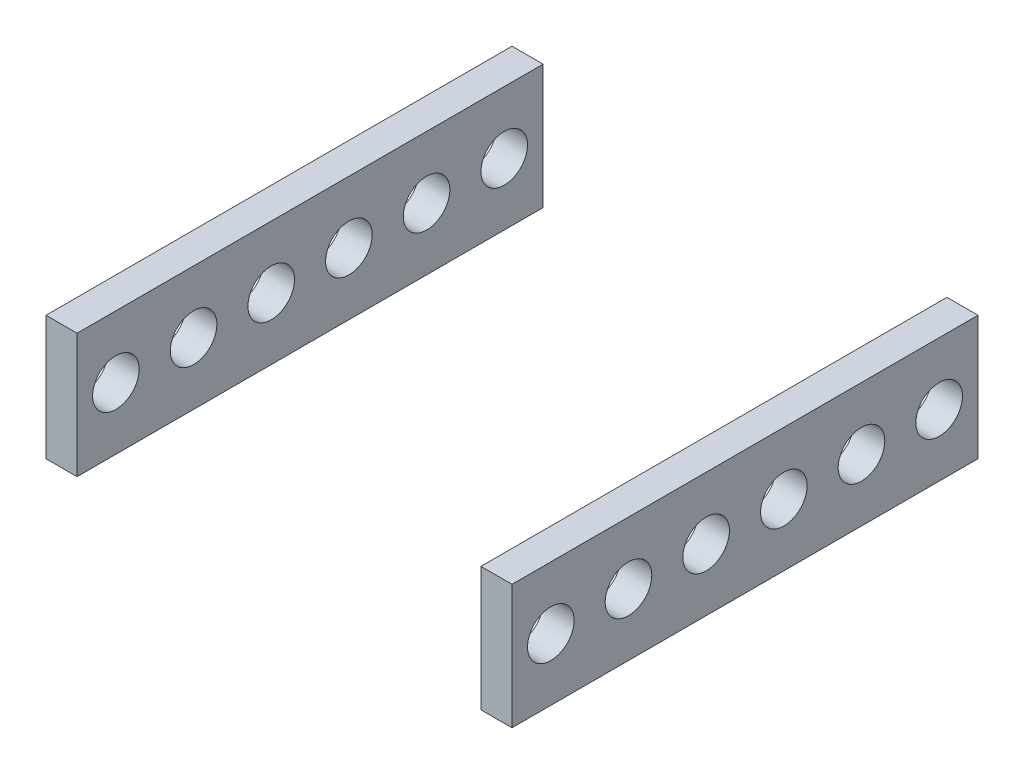
ISO-10303-21;
HEADER;
FILE_DESCRIPTION(('STEP AP214'),'2;1');
FILE_NAME('part.step','',(''),(''),'','','');
FILE_SCHEMA(('AUTOMOTIVE_DESIGN { 1 0 10303 214 1 1 1 1 }'));
ENDSEC;
DATA;
#1=APPLICATION_CONTEXT('core data for automotive mechanical design processes');
#2=APPLICATION_PROTOCOL_DEFINITION('international standard','automotive_design',2000,#1);
#3=PRODUCT_CONTEXT('',#1,'mechanical');
#4=PRODUCT('Part','Part','',(#3));
#5=PRODUCT_RELATED_PRODUCT_CATEGORY('part','',(#4));
#6=PRODUCT_DEFINITION_FORMATION('','',#4);
#7=PRODUCT_DEFINITION_CONTEXT('part definition',#1,'design');
#8=PRODUCT_DEFINITION('design','',#6,#7);
#9=PRODUCT_DEFINITION_SHAPE('','',#8);
#10=(LENGTH_UNIT() NAMED_UNIT(*) SI_UNIT(.MILLI.,.METRE.));
#11=(NAMED_UNIT(*) PLANE_ANGLE_UNIT() SI_UNIT($,.RADIAN.));
#12=(NAMED_UNIT(*) SI_UNIT($,.STERADIAN.) SOLID_ANGLE_UNIT());
#13=UNCERTAINTY_MEASURE_WITH_UNIT(LENGTH_MEASURE(1.E-05),#10,'distance_accuracy_value','');
#14=(GEOMETRIC_REPRESENTATION_CONTEXT(3) GLOBAL_UNCERTAINTY_ASSIGNED_CONTEXT((#13)) GLOBAL_UNIT_ASSIGNED_CONTEXT((#10,
#11,#12)) REPRESENTATION_CONTEXT('',''));
#15=CARTESIAN_POINT('',(0.,0.,0.));
#16=DIRECTION('',(0.,0.,1.));
#17=DIRECTION('',(1.,0.,0.));
#18=AXIS2_PLACEMENT_3D('',#15,#16,#17);
#19=CARTESIAN_POINT('',(-254.832138860458,0.,300.));
#20=DIRECTION('',(1.,0.,0.));
#21=DIRECTION('',(0.,0.,-1.));
#22=AXIS2_PLACEMENT_3D('',#19,#20,#21);
#23=PLANE('',#22);
#24=CARTESIAN_POINT('',(-254.832138860458,-10.8737780043899,225.));
#25=DIRECTION('',(1.,0.,0.));
#26=DIRECTION('',(0.,0.,-1.));
#27=AXIS2_PLACEMENT_3D('',#24,#25,#26);
#28=CIRCLE('',#27,15.);
#29=CARTESIAN_POINT('',(-254.832138860458,-10.8737780043899,210.));
#30=VERTEX_POINT('',#29);
#31=EDGE_CURVE('E148',#30,#30,#28,.T.);
#32=ORIENTED_EDGE('',*,*,#31,.F.);
#33=EDGE_LOOP('',(#32));
#34=FACE_BOUND('',#33,.T.);
#35=CARTESIAN_POINT('',(-254.832138860458,-10.8737780043899,175.));
#36=DIRECTION('',(1.,0.,0.));
#37=DIRECTION('',(0.,0.,-1.));
#38=AXIS2_PLACEMENT_3D('',#35,#36,#37);
#39=CIRCLE('',#38,15.);
#40=CARTESIAN_POINT('',(-254.832138860458,-10.8737780043899,160.));
#41=VERTEX_POINT('',#40);
#42=EDGE_CURVE('E142',#41,#41,#39,.T.);
#43=ORIENTED_EDGE('',*,*,#42,.F.);
#44=EDGE_LOOP('',(#43));
#45=FACE_BOUND('',#44,.T.);
#46=CARTESIAN_POINT('',(-254.832138860458,-10.8737780043899,125.));
#47=DIRECTION('',(1.,0.,0.));
#48=DIRECTION('',(0.,0.,-1.));
#49=AXIS2_PLACEMENT_3D('',#46,#47,#48);
#50=CIRCLE('',#49,15.);
#51=CARTESIAN_POINT('',(-254.832138860458,-10.8737780043899,110.));
#52=VERTEX_POINT('',#51);
#53=EDGE_CURVE('E136',#52,#52,#50,.T.);
#54=ORIENTED_EDGE('',*,*,#53,.F.);
#55=EDGE_LOOP('',(#54));
#56=FACE_BOUND('',#55,.T.);
#57=CARTESIAN_POINT('',(-254.832138860458,-10.8737780043899,75.));
#58=DIRECTION('',(1.,0.,0.));
#59=DIRECTION('',(0.,0.,-1.));
#60=AXIS2_PLACEMENT_3D('',#57,#58,#59);
#61=CIRCLE('',#60,15.);
#62=CARTESIAN_POINT('',(-254.832138860458,-10.8737780043899,60.));
#63=VERTEX_POINT('',#62);
#64=EDGE_CURVE('E130',#63,#63,#61,.T.);
#65=ORIENTED_EDGE('',*,*,#64,.F.);
#66=EDGE_LOOP('',(#65));
#67=FACE_BOUND('',#66,.T.);
#68=CARTESIAN_POINT('',(-254.832138860458,-10.8737780043899,275.));
#69=DIRECTION('',(1.,0.,0.));
#70=DIRECTION('',(0.,0.,-1.));
#71=AXIS2_PLACEMENT_3D('',#68,#69,#70);
#72=CIRCLE('',#71,15.);
#73=CARTESIAN_POINT('',(-254.832138860458,-10.8737780043899,260.));
#74=VERTEX_POINT('',#73);
#75=EDGE_CURVE('E124',#74,#74,#72,.T.);
#76=ORIENTED_EDGE('',*,*,#75,.F.);
#77=EDGE_LOOP('',(#76));
#78=FACE_BOUND('',#77,.T.);
#79=CARTESIAN_POINT('',(-254.832138860458,-10.8737780043899,25.));
#80=DIRECTION('',(1.,0.,0.));
#81=DIRECTION('',(0.,0.,-1.));
#82=AXIS2_PLACEMENT_3D('',#79,#80,#81);
#83=CIRCLE('',#82,15.);
#84=CARTESIAN_POINT('',(-254.832138860458,-10.8737780043899,10.));
#85=VERTEX_POINT('',#84);
#86=EDGE_CURVE('E109',#85,#85,#83,.T.);
#87=ORIENTED_EDGE('',*,*,#86,.F.);
#88=EDGE_LOOP('',(#87));
#89=FACE_BOUND('',#88,.T.);
#90=DIRECTION('',(0.,-1.,0.));
#91=VECTOR('',#90,1.);
#92=CARTESIAN_POINT('',(-254.832138860458,0.,0.));
#93=LINE('',#92,#91);
#94=CARTESIAN_POINT('',(-254.832138860458,29.12622199561,0.));
#95=VERTEX_POINT('',#94);
#96=CARTESIAN_POINT('',(-254.832138860458,-50.8737780043899,0.));
#97=VERTEX_POINT('',#96);
#98=EDGE_CURVE('E107',#95,#97,#93,.T.);
#99=ORIENTED_EDGE('',*,*,#98,.F.);
#100=DIRECTION('',(0.,0.,-1.));
#101=VECTOR('',#100,1.);
#102=CARTESIAN_POINT('',(-254.832138860458,29.12622199561,300.));
#103=LINE('',#102,#101);
#104=CARTESIAN_POINT('',(-254.832138860458,29.12622199561,300.));
#105=VERTEX_POINT('',#104);
#106=EDGE_CURVE('E12',#105,#95,#103,.T.);
#107=ORIENTED_EDGE('',*,*,#106,.F.);
#108=DIRECTION('',(0.,-1.,0.));
#109=VECTOR('',#108,1.);
#110=CARTESIAN_POINT('',(-254.832138860458,0.,300.));
#111=LINE('',#110,#109);
#112=CARTESIAN_POINT('',(-254.832138860458,-50.8737780043899,300.));
#113=VERTEX_POINT('',#112);
#114=EDGE_CURVE('E92',#105,#113,#111,.T.);
#115=ORIENTED_EDGE('',*,*,#114,.T.);
#116=DIRECTION('',(0.,0.,-1.));
#117=VECTOR('',#116,1.);
#118=CARTESIAN_POINT('',(-254.832138860458,-50.8737780043899,300.));
#119=LINE('',#118,#117);
#120=EDGE_CURVE('E60',#113,#97,#119,.T.);
#121=ORIENTED_EDGE('',*,*,#120,.T.);
#122=EDGE_LOOP('',(#99,#107,#115,#121));
#123=FACE_BOUND('',#122,.T.);
#124=ADVANCED_FACE('F44',(#34,#45,#56,#67,#78,#89,#123),#23,.T.);
#125=CARTESIAN_POINT('',(0.,29.12622199561,300.));
#126=DIRECTION('',(0.,-1.,0.));
#127=DIRECTION('',(0.,0.,-1.));
#128=AXIS2_PLACEMENT_3D('',#125,#126,#127);
#129=PLANE('',#128);
#130=DIRECTION('',(-1.,0.,0.));
#131=VECTOR('',#130,1.);
#132=CARTESIAN_POINT('',(0.,29.12622199561,0.));
#133=LINE('',#132,#131);
#134=CARTESIAN_POINT('',(-274.832138860458,29.12622199561,0.));
#135=VERTEX_POINT('',#134);
#136=EDGE_CURVE('E98',#95,#135,#133,.T.);
#137=ORIENTED_EDGE('',*,*,#136,.T.);
#138=DIRECTION('',(0.,0.,-1.));
#139=VECTOR('',#138,1.);
#140=CARTESIAN_POINT('',(-274.832138860458,29.12622199561,300.));
#141=LINE('',#140,#139);
#142=CARTESIAN_POINT('',(-274.832138860458,29.12622199561,300.));
#143=VERTEX_POINT('',#142);
#144=EDGE_CURVE('E52',#143,#135,#141,.T.);
#145=ORIENTED_EDGE('',*,*,#144,.F.);
#146=DIRECTION('',(-1.,0.,0.));
#147=VECTOR('',#146,1.);
#148=CARTESIAN_POINT('',(0.,29.12622199561,300.));
#149=LINE('',#148,#147);
#150=EDGE_CURVE('E86',#105,#143,#149,.T.);
#151=ORIENTED_EDGE('',*,*,#150,.F.);
#152=ORIENTED_EDGE('',*,*,#106,.T.);
#153=EDGE_LOOP('',(#137,#145,#151,#152));
#154=FACE_BOUND('',#153,.T.);
#155=ADVANCED_FACE('F96',(#154),#129,.F.);
#156=CARTESIAN_POINT('',(-274.832138860458,0.,300.));
#157=DIRECTION('',(1.,0.,0.));
#158=DIRECTION('',(0.,0.,-1.));
#159=AXIS2_PLACEMENT_3D('',#156,#157,#158);
#160=PLANE('',#159);
#161=CARTESIAN_POINT('',(-274.832138860458,-10.8737780043899,225.));
#162=DIRECTION('',(-1.,0.,0.));
#163=DIRECTION('',(0.,0.,1.));
#164=AXIS2_PLACEMENT_3D('',#161,#162,#163);
#165=CIRCLE('',#164,15.);
#166=CARTESIAN_POINT('',(-274.832138860458,-10.8737780043899,240.));
#167=VERTEX_POINT('',#166);
#168=EDGE_CURVE('E151',#167,#167,#165,.T.);
#169=ORIENTED_EDGE('',*,*,#168,.F.);
#170=EDGE_LOOP('',(#169));
#171=FACE_BOUND('',#170,.T.);
#172=CARTESIAN_POINT('',(-274.832138860458,-10.8737780043899,175.));
#173=DIRECTION('',(-1.,0.,0.));
#174=DIRECTION('',(0.,0.,1.));
#175=AXIS2_PLACEMENT_3D('',#172,#173,#174);
#176=CIRCLE('',#175,15.);
#177=CARTESIAN_POINT('',(-274.832138860458,-10.8737780043899,190.));
#178=VERTEX_POINT('',#177);
#179=EDGE_CURVE('E145',#178,#178,#176,.T.);
#180=ORIENTED_EDGE('',*,*,#179,.F.);
#181=EDGE_LOOP('',(#180));
#182=FACE_BOUND('',#181,.T.);
#183=CARTESIAN_POINT('',(-274.832138860458,-10.8737780043899,125.));
#184=DIRECTION('',(-1.,0.,0.));
#185=DIRECTION('',(0.,0.,1.));
#186=AXIS2_PLACEMENT_3D('',#183,#184,#185);
#187=CIRCLE('',#186,15.);
#188=CARTESIAN_POINT('',(-274.832138860458,-10.8737780043899,140.));
#189=VERTEX_POINT('',#188);
#190=EDGE_CURVE('E139',#189,#189,#187,.T.);
#191=ORIENTED_EDGE('',*,*,#190,.F.);
#192=EDGE_LOOP('',(#191));
#193=FACE_BOUND('',#192,.T.);
#194=CARTESIAN_POINT('',(-274.832138860458,-10.8737780043899,75.));
#195=DIRECTION('',(-1.,0.,0.));
#196=DIRECTION('',(0.,0.,1.));
#197=AXIS2_PLACEMENT_3D('',#194,#195,#196);
#198=CIRCLE('',#197,15.);
#199=CARTESIAN_POINT('',(-274.832138860458,-10.8737780043899,90.));
#200=VERTEX_POINT('',#199);
#201=EDGE_CURVE('E133',#200,#200,#198,.T.);
#202=ORIENTED_EDGE('',*,*,#201,.F.);
#203=EDGE_LOOP('',(#202));
#204=FACE_BOUND('',#203,.T.);
#205=CARTESIAN_POINT('',(-274.832138860458,-10.8737780043899,275.));
#206=DIRECTION('',(-1.,0.,0.));
#207=DIRECTION('',(0.,0.,1.));
#208=AXIS2_PLACEMENT_3D('',#205,#206,#207);
#209=CIRCLE('',#208,15.);
#210=CARTESIAN_POINT('',(-274.832138860458,-10.8737780043899,290.));
#211=VERTEX_POINT('',#210);
#212=EDGE_CURVE('E127',#211,#211,#209,.T.);
#213=ORIENTED_EDGE('',*,*,#212,.F.);
#214=EDGE_LOOP('',(#213));
#215=FACE_BOUND('',#214,.T.);
#216=CARTESIAN_POINT('',(-274.832138860458,-10.8737780043899,25.));
#217=DIRECTION('',(-1.,0.,0.));
#218=DIRECTION('',(0.,0.,1.));
#219=AXIS2_PLACEMENT_3D('',#216,#217,#218);
#220=CIRCLE('',#219,15.);
#221=CARTESIAN_POINT('',(-274.832138860458,-10.8737780043899,40.));
#222=VERTEX_POINT('',#221);
#223=EDGE_CURVE('E121',#222,#222,#220,.T.);
#224=ORIENTED_EDGE('',*,*,#223,.F.);
#225=EDGE_LOOP('',(#224));
#226=FACE_BOUND('',#225,.T.);
#227=DIRECTION('',(0.,-1.,0.));
#228=VECTOR('',#227,1.);
#229=CARTESIAN_POINT('',(-274.832138860458,0.,0.));
#230=LINE('',#229,#228);
#231=CARTESIAN_POINT('',(-274.832138860458,-50.8737780043899,0.));
#232=VERTEX_POINT('',#231);
#233=EDGE_CURVE('E111',#135,#232,#230,.T.);
#234=ORIENTED_EDGE('',*,*,#233,.T.);
#235=DIRECTION('',(0.,0.,-1.));
#236=VECTOR('',#235,1.);
#237=CARTESIAN_POINT('',(-274.832138860458,-50.8737780043899,300.));
#238=LINE('',#237,#236);
#239=CARTESIAN_POINT('',(-274.832138860458,-50.8737780043899,300.));
#240=VERTEX_POINT('',#239);
#241=EDGE_CURVE('E74',#240,#232,#238,.T.);
#242=ORIENTED_EDGE('',*,*,#241,.F.);
#243=DIRECTION('',(0.,-1.,0.));
#244=VECTOR('',#243,1.);
#245=CARTESIAN_POINT('',(-274.832138860458,0.,300.));
#246=LINE('',#245,#244);
#247=EDGE_CURVE('E91',#143,#240,#246,.T.);
#248=ORIENTED_EDGE('',*,*,#247,.F.);
#249=ORIENTED_EDGE('',*,*,#144,.T.);
#250=EDGE_LOOP('',(#234,#242,#248,#249));
#251=FACE_BOUND('',#250,.T.);
#252=ADVANCED_FACE('F101',(#171,#182,#193,#204,#215,#226,#251),#160,.F.);
#253=CARTESIAN_POINT('',(0.,-50.8737780043899,300.));
#254=DIRECTION('',(0.,-1.,0.));
#255=DIRECTION('',(0.,0.,-1.));
#256=AXIS2_PLACEMENT_3D('',#253,#254,#255);
#257=PLANE('',#256);
#258=DIRECTION('',(-1.,0.,0.));
#259=VECTOR('',#258,1.);
#260=CARTESIAN_POINT('',(0.,-50.8737780043899,0.));
#261=LINE('',#260,#259);
#262=EDGE_CURVE('E113',#97,#232,#261,.T.);
#263=ORIENTED_EDGE('',*,*,#262,.F.);
#264=ORIENTED_EDGE('',*,*,#120,.F.);
#265=DIRECTION('',(-1.,0.,0.));
#266=VECTOR('',#265,1.);
#267=CARTESIAN_POINT('',(0.,-50.8737780043899,300.));
#268=LINE('',#267,#266);
#269=EDGE_CURVE('E102',#113,#240,#268,.T.);
#270=ORIENTED_EDGE('',*,*,#269,.T.);
#271=ORIENTED_EDGE('',*,*,#241,.T.);
#272=EDGE_LOOP('',(#263,#264,#270,#271));
#273=FACE_BOUND('',#272,.T.);
#274=ADVANCED_FACE('F159',(#273),#257,.T.);
#275=CARTESIAN_POINT('',(0.,0.,300.));
#276=DIRECTION('',(0.,0.,1.));
#277=DIRECTION('',(1.,0.,0.));
#278=AXIS2_PLACEMENT_3D('',#275,#276,#277);
#279=PLANE('',#278);
#280=ORIENTED_EDGE('',*,*,#114,.F.);
#281=ORIENTED_EDGE('',*,*,#150,.T.);
#282=ORIENTED_EDGE('',*,*,#247,.T.);
#283=ORIENTED_EDGE('',*,*,#269,.F.);
#284=EDGE_LOOP('',(#280,#281,#282,#283));
#285=FACE_BOUND('',#284,.T.);
#286=ADVANCED_FACE('F88',(#285),#279,.T.);
#287=CARTESIAN_POINT('',(0.,0.,0.));
#288=DIRECTION('',(0.,0.,1.));
#289=DIRECTION('',(1.,0.,0.));
#290=AXIS2_PLACEMENT_3D('',#287,#288,#289);
#291=PLANE('',#290);
#292=ORIENTED_EDGE('',*,*,#98,.T.);
#293=ORIENTED_EDGE('',*,*,#262,.T.);
#294=ORIENTED_EDGE('',*,*,#233,.F.);
#295=ORIENTED_EDGE('',*,*,#136,.F.);
#296=EDGE_LOOP('',(#292,#293,#294,#295));
#297=FACE_BOUND('',#296,.T.);
#298=ADVANCED_FACE('F174',(#297),#291,.F.);
#299=CARTESIAN_POINT('',(25.1678611395419,-10.8737780043899,25.));
#300=DIRECTION('',(-1.,0.,0.));
#301=DIRECTION('',(0.,0.,1.));
#302=AXIS2_PLACEMENT_3D('',#299,#300,#301);
#303=CYLINDRICAL_SURFACE('',#302,15.);
#304=ORIENTED_EDGE('',*,*,#86,.T.);
#305=EDGE_LOOP('',(#304));
#306=FACE_BOUND('',#305,.T.);
#307=ORIENTED_EDGE('',*,*,#223,.T.);
#308=EDGE_LOOP('',(#307));
#309=FACE_BOUND('',#308,.T.);
#310=ADVANCED_FACE('F171',(#306,#309),#303,.F.);
#311=CARTESIAN_POINT('',(25.1678611395419,-10.8737780043899,275.));
#312=DIRECTION('',(-1.,0.,0.));
#313=DIRECTION('',(0.,0.,1.));
#314=AXIS2_PLACEMENT_3D('',#311,#312,#313);
#315=CYLINDRICAL_SURFACE('',#314,15.);
#316=ORIENTED_EDGE('',*,*,#75,.T.);
#317=EDGE_LOOP('',(#316));
#318=FACE_BOUND('',#317,.T.);
#319=ORIENTED_EDGE('',*,*,#212,.T.);
#320=EDGE_LOOP('',(#319));
#321=FACE_BOUND('',#320,.T.);
#322=ADVANCED_FACE('F173',(#318,#321),#315,.F.);
#323=CARTESIAN_POINT('',(25.1678611395419,-10.8737780043899,75.));
#324=DIRECTION('',(-1.,0.,0.));
#325=DIRECTION('',(0.,0.,1.));
#326=AXIS2_PLACEMENT_3D('',#323,#324,#325);
#327=CYLINDRICAL_SURFACE('',#326,15.);
#328=ORIENTED_EDGE('',*,*,#64,.T.);
#329=EDGE_LOOP('',(#328));
#330=FACE_BOUND('',#329,.T.);
#331=ORIENTED_EDGE('',*,*,#201,.T.);
#332=EDGE_LOOP('',(#331));
#333=FACE_BOUND('',#332,.T.);
#334=ADVANCED_FACE('F181',(#330,#333),#327,.F.);
#335=CARTESIAN_POINT('',(25.1678611395419,-10.8737780043899,125.));
#336=DIRECTION('',(-1.,0.,0.));
#337=DIRECTION('',(0.,0.,1.));
#338=AXIS2_PLACEMENT_3D('',#335,#336,#337);
#339=CYLINDRICAL_SURFACE('',#338,15.);
#340=ORIENTED_EDGE('',*,*,#53,.T.);
#341=EDGE_LOOP('',(#340));
#342=FACE_BOUND('',#341,.T.);
#343=ORIENTED_EDGE('',*,*,#190,.T.);
#344=EDGE_LOOP('',(#343));
#345=FACE_BOUND('',#344,.T.);
#346=ADVANCED_FACE('F244',(#342,#345),#339,.F.);
#347=CARTESIAN_POINT('',(25.1678611395419,-10.8737780043899,175.));
#348=DIRECTION('',(-1.,0.,0.));
#349=DIRECTION('',(0.,0.,1.));
#350=AXIS2_PLACEMENT_3D('',#347,#348,#349);
#351=CYLINDRICAL_SURFACE('',#350,15.);
#352=ORIENTED_EDGE('',*,*,#42,.T.);
#353=EDGE_LOOP('',(#352));
#354=FACE_BOUND('',#353,.T.);
#355=ORIENTED_EDGE('',*,*,#179,.T.);
#356=EDGE_LOOP('',(#355));
#357=FACE_BOUND('',#356,.T.);
#358=ADVANCED_FACE('F254',(#354,#357),#351,.F.);
#359=CARTESIAN_POINT('',(25.1678611395419,-10.8737780043899,225.));
#360=DIRECTION('',(-1.,0.,0.));
#361=DIRECTION('',(0.,0.,1.));
#362=AXIS2_PLACEMENT_3D('',#359,#360,#361);
#363=CYLINDRICAL_SURFACE('',#362,15.);
#364=ORIENTED_EDGE('',*,*,#31,.T.);
#365=EDGE_LOOP('',(#364));
#366=FACE_BOUND('',#365,.T.);
#367=ORIENTED_EDGE('',*,*,#168,.T.);
#368=EDGE_LOOP('',(#367));
#369=FACE_BOUND('',#368,.T.);
#370=ADVANCED_FACE('F155',(#366,#369),#363,.F.);
#371=CLOSED_SHELL('',(#124,#155,#252,#274,#286,#298,#310,#322,#334,#346,#358,#370));
#372=MANIFOLD_SOLID_BREP('B2',#371);
#373=CARTESIAN_POINT('',(25.155083539046,0.,300.));
#374=DIRECTION('',(1.,0.,0.));
#375=DIRECTION('',(0.,0.,-1.));
#376=AXIS2_PLACEMENT_3D('',#373,#374,#375);
#377=PLANE('',#376);
#378=CARTESIAN_POINT('',(25.155083539046,-10.8737780043899,225.));
#379=DIRECTION('',(1.,0.,0.));
#380=DIRECTION('',(0.,0.,-1.));
#381=AXIS2_PLACEMENT_3D('',#378,#379,#380);
#382=CIRCLE('',#381,15.);
#383=CARTESIAN_POINT('',(25.155083539046,-10.8737780043899,210.));
#384=VERTEX_POINT('',#383);
#385=EDGE_CURVE('E386',#384,#384,#382,.T.);
#386=ORIENTED_EDGE('',*,*,#385,.F.);
#387=EDGE_LOOP('',(#386));
#388=FACE_BOUND('',#387,.T.);
#389=CARTESIAN_POINT('',(25.155083539046,-10.8737780043899,175.));
#390=DIRECTION('',(1.,0.,0.));
#391=DIRECTION('',(0.,0.,-1.));
#392=AXIS2_PLACEMENT_3D('',#389,#390,#391);
#393=CIRCLE('',#392,15.);
#394=CARTESIAN_POINT('',(25.155083539046,-10.8737780043899,160.));
#395=VERTEX_POINT('',#394);
#396=EDGE_CURVE('E383',#395,#395,#393,.T.);
#397=ORIENTED_EDGE('',*,*,#396,.F.);
#398=EDGE_LOOP('',(#397));
#399=FACE_BOUND('',#398,.T.);
#400=CARTESIAN_POINT('',(25.155083539046,-10.8737780043899,125.));
#401=DIRECTION('',(1.,0.,0.));
#402=DIRECTION('',(0.,0.,-1.));
#403=AXIS2_PLACEMENT_3D('',#400,#401,#402);
#404=CIRCLE('',#403,15.);
#405=CARTESIAN_POINT('',(25.155083539046,-10.8737780043899,110.));
#406=VERTEX_POINT('',#405);
#407=EDGE_CURVE('E380',#406,#406,#404,.T.);
#408=ORIENTED_EDGE('',*,*,#407,.F.);
#409=EDGE_LOOP('',(#408));
#410=FACE_BOUND('',#409,.T.);
#411=CARTESIAN_POINT('',(25.155083539046,-10.8737780043899,75.));
#412=DIRECTION('',(1.,0.,0.));
#413=DIRECTION('',(0.,0.,-1.));
#414=AXIS2_PLACEMENT_3D('',#411,#412,#413);
#415=CIRCLE('',#414,15.);
#416=CARTESIAN_POINT('',(25.155083539046,-10.8737780043899,60.));
#417=VERTEX_POINT('',#416);
#418=EDGE_CURVE('E376',#417,#417,#415,.T.);
#419=ORIENTED_EDGE('',*,*,#418,.F.);
#420=EDGE_LOOP('',(#419));
#421=FACE_BOUND('',#420,.T.);
#422=CARTESIAN_POINT('',(25.155083539046,-10.8737780043899,275.));
#423=DIRECTION('',(1.,0.,0.));
#424=DIRECTION('',(0.,0.,-1.));
#425=AXIS2_PLACEMENT_3D('',#422,#423,#424);
#426=CIRCLE('',#425,15.);
#427=CARTESIAN_POINT('',(25.155083539046,-10.8737780043899,260.));
#428=VERTEX_POINT('',#427);
#429=EDGE_CURVE('E372',#428,#428,#426,.T.);
#430=ORIENTED_EDGE('',*,*,#429,.F.);
#431=EDGE_LOOP('',(#430));
#432=FACE_BOUND('',#431,.T.);
#433=CARTESIAN_POINT('',(25.155083539046,-10.8737780043899,25.));
#434=DIRECTION('',(1.,0.,0.));
#435=DIRECTION('',(0.,0.,-1.));
#436=AXIS2_PLACEMENT_3D('',#433,#434,#435);
#437=CIRCLE('',#436,15.);
#438=CARTESIAN_POINT('',(25.155083539046,-10.8737780043899,10.));
#439=VERTEX_POINT('',#438);
#440=EDGE_CURVE('E363',#439,#439,#437,.T.);
#441=ORIENTED_EDGE('',*,*,#440,.F.);
#442=EDGE_LOOP('',(#441));
#443=FACE_BOUND('',#442,.T.);
#444=DIRECTION('',(0.,-1.,0.));
#445=VECTOR('',#444,1.);
#446=CARTESIAN_POINT('',(25.155083539046,0.,0.));
#447=LINE('',#446,#445);
#448=CARTESIAN_POINT('',(25.155083539046,29.1262219956101,0.));
#449=VERTEX_POINT('',#448);
#450=CARTESIAN_POINT('',(25.155083539046,-50.8737780043899,0.));
#451=VERTEX_POINT('',#450);
#452=EDGE_CURVE('E360',#449,#451,#447,.T.);
#453=ORIENTED_EDGE('',*,*,#452,.F.);
#454=DIRECTION('',(0.,0.,-1.));
#455=VECTOR('',#454,1.);
#456=CARTESIAN_POINT('',(25.155083539046,29.1262219956101,300.));
#457=LINE('',#456,#455);
#458=CARTESIAN_POINT('',(25.155083539046,29.1262219956101,300.));
#459=VERTEX_POINT('',#458);
#460=EDGE_CURVE('E42',#459,#449,#457,.T.);
#461=ORIENTED_EDGE('',*,*,#460,.F.);
#462=DIRECTION('',(0.,-1.,0.));
#463=VECTOR('',#462,1.);
#464=CARTESIAN_POINT('',(25.155083539046,0.,300.));
#465=LINE('',#464,#463);
#466=CARTESIAN_POINT('',(25.155083539046,-50.8737780043899,300.));
#467=VERTEX_POINT('',#466);
#468=EDGE_CURVE('E353',#459,#467,#465,.T.);
#469=ORIENTED_EDGE('',*,*,#468,.T.);
#470=DIRECTION('',(0.,0.,-1.));
#471=VECTOR('',#470,1.);
#472=CARTESIAN_POINT('',(25.155083539046,-50.8737780043899,300.));
#473=LINE('',#472,#471);
#474=EDGE_CURVE('E333',#467,#451,#473,.T.);
#475=ORIENTED_EDGE('',*,*,#474,.T.);
#476=EDGE_LOOP('',(#453,#461,#469,#475));
#477=FACE_BOUND('',#476,.T.);
#478=ADVANCED_FACE('F293',(#388,#399,#410,#421,#432,#443,#477),#377,.T.);
#479=CARTESIAN_POINT('',(0.,29.1262219956101,300.));
#480=DIRECTION('',(0.,1.,0.));
#481=DIRECTION('',(0.,0.,1.));
#482=AXIS2_PLACEMENT_3D('',#479,#480,#481);
#483=PLANE('',#482);
#484=DIRECTION('',(1.,0.,0.));
#485=VECTOR('',#484,1.);
#486=CARTESIAN_POINT('',(0.,29.1262219956101,0.));
#487=LINE('',#486,#485);
#488=CARTESIAN_POINT('',(5.15508353904603,29.1262219956101,0.));
#489=VERTEX_POINT('',#488);
#490=EDGE_CURVE('E346',#489,#449,#487,.T.);
#491=ORIENTED_EDGE('',*,*,#490,.F.);
#492=DIRECTION('',(0.,0.,-1.));
#493=VECTOR('',#492,1.);
#494=CARTESIAN_POINT('',(5.15508353904603,29.1262219956101,300.));
#495=LINE('',#494,#493);
#496=CARTESIAN_POINT('',(5.15508353904603,29.1262219956101,300.));
#497=VERTEX_POINT('',#496);
#498=EDGE_CURVE('E302',#497,#489,#495,.T.);
#499=ORIENTED_EDGE('',*,*,#498,.F.);
#500=DIRECTION('',(1.,0.,0.));
#501=VECTOR('',#500,1.);
#502=CARTESIAN_POINT('',(0.,29.1262219956101,300.));
#503=LINE('',#502,#501);
#504=EDGE_CURVE('E344',#497,#459,#503,.T.);
#505=ORIENTED_EDGE('',*,*,#504,.T.);
#506=ORIENTED_EDGE('',*,*,#460,.T.);
#507=EDGE_LOOP('',(#491,#499,#505,#506));
#508=FACE_BOUND('',#507,.T.);
#509=ADVANCED_FACE('F342',(#508),#483,.T.);
#510=CARTESIAN_POINT('',(5.15508353904603,0.,300.));
#511=DIRECTION('',(1.,0.,0.));
#512=DIRECTION('',(0.,0.,-1.));
#513=AXIS2_PLACEMENT_3D('',#510,#511,#512);
#514=PLANE('',#513);
#515=CARTESIAN_POINT('',(5.15508353904603,-10.8737780043899,225.));
#516=DIRECTION('',(1.,0.,0.));
#517=DIRECTION('',(0.,0.,-1.));
#518=AXIS2_PLACEMENT_3D('',#515,#516,#517);
#519=CIRCLE('',#518,15.);
#520=CARTESIAN_POINT('',(5.15508353904603,-10.8737780043899,210.));
#521=VERTEX_POINT('',#520);
#522=EDGE_CURVE('E296',#521,#521,#519,.T.);
#523=ORIENTED_EDGE('',*,*,#522,.T.);
#524=EDGE_LOOP('',(#523));
#525=FACE_BOUND('',#524,.T.);
#526=CARTESIAN_POINT('',(5.15508353904603,-10.8737780043899,175.));
#527=DIRECTION('',(1.,0.,0.));
#528=DIRECTION('',(0.,0.,-1.));
#529=AXIS2_PLACEMENT_3D('',#526,#527,#528);
#530=CIRCLE('',#529,15.);
#531=CARTESIAN_POINT('',(5.15508353904603,-10.8737780043899,160.));
#532=VERTEX_POINT('',#531);
#533=EDGE_CURVE('E384',#532,#532,#530,.T.);
#534=ORIENTED_EDGE('',*,*,#533,.T.);
#535=EDGE_LOOP('',(#534));
#536=FACE_BOUND('',#535,.T.);
#537=CARTESIAN_POINT('',(5.15508353904603,-10.8737780043899,125.));
#538=DIRECTION('',(1.,0.,0.));
#539=DIRECTION('',(0.,0.,-1.));
#540=AXIS2_PLACEMENT_3D('',#537,#538,#539);
#541=CIRCLE('',#540,15.);
#542=CARTESIAN_POINT('',(5.15508353904603,-10.8737780043899,110.));
#543=VERTEX_POINT('',#542);
#544=EDGE_CURVE('E381',#543,#543,#541,.T.);
#545=ORIENTED_EDGE('',*,*,#544,.T.);
#546=EDGE_LOOP('',(#545));
#547=FACE_BOUND('',#546,.T.);
#548=CARTESIAN_POINT('',(5.15508353904603,-10.8737780043899,75.));
#549=DIRECTION('',(1.,0.,0.));
#550=DIRECTION('',(0.,0.,-1.));
#551=AXIS2_PLACEMENT_3D('',#548,#549,#550);
#552=CIRCLE('',#551,15.);
#553=CARTESIAN_POINT('',(5.15508353904603,-10.8737780043899,60.));
#554=VERTEX_POINT('',#553);
#555=EDGE_CURVE('E377',#554,#554,#552,.T.);
#556=ORIENTED_EDGE('',*,*,#555,.T.);
#557=EDGE_LOOP('',(#556));
#558=FACE_BOUND('',#557,.T.);
#559=CARTESIAN_POINT('',(5.15508353904603,-10.8737780043899,275.));
#560=DIRECTION('',(1.,0.,0.));
#561=DIRECTION('',(0.,0.,-1.));
#562=AXIS2_PLACEMENT_3D('',#559,#560,#561);
#563=CIRCLE('',#562,15.);
#564=CARTESIAN_POINT('',(5.15508353904603,-10.8737780043899,260.));
#565=VERTEX_POINT('',#564);
#566=EDGE_CURVE('E373',#565,#565,#563,.T.);
#567=ORIENTED_EDGE('',*,*,#566,.T.);
#568=EDGE_LOOP('',(#567));
#569=FACE_BOUND('',#568,.T.);
#570=CARTESIAN_POINT('',(5.15508353904603,-10.8737780043899,25.));
#571=DIRECTION('',(1.,0.,0.));
#572=DIRECTION('',(0.,0.,-1.));
#573=AXIS2_PLACEMENT_3D('',#570,#571,#572);
#574=CIRCLE('',#573,15.);
#575=CARTESIAN_POINT('',(5.15508353904603,-10.8737780043899,10.));
#576=VERTEX_POINT('',#575);
#577=EDGE_CURVE('E369',#576,#576,#574,.T.);
#578=ORIENTED_EDGE('',*,*,#577,.T.);
#579=EDGE_LOOP('',(#578));
#580=FACE_BOUND('',#579,.T.);
#581=DIRECTION('',(0.,-1.,0.));
#582=VECTOR('',#581,1.);
#583=CARTESIAN_POINT('',(5.15508353904603,0.,0.));
#584=LINE('',#583,#582);
#585=CARTESIAN_POINT('',(5.15508353904603,-50.8737780043899,0.));
#586=VERTEX_POINT('',#585);
#587=EDGE_CURVE('E326',#489,#586,#584,.T.);
#588=ORIENTED_EDGE('',*,*,#587,.T.);
#589=DIRECTION('',(0.,0.,-1.));
#590=VECTOR('',#589,1.);
#591=CARTESIAN_POINT('',(5.15508353904603,-50.8737780043899,300.));
#592=LINE('',#591,#590);
#593=CARTESIAN_POINT('',(5.15508353904603,-50.8737780043899,300.));
#594=VERTEX_POINT('',#593);
#595=EDGE_CURVE('E347',#594,#586,#592,.T.);
#596=ORIENTED_EDGE('',*,*,#595,.F.);
#597=DIRECTION('',(0.,-1.,0.));
#598=VECTOR('',#597,1.);
#599=CARTESIAN_POINT('',(5.15508353904603,0.,300.));
#600=LINE('',#599,#598);
#601=EDGE_CURVE('E349',#497,#594,#600,.T.);
#602=ORIENTED_EDGE('',*,*,#601,.F.);
#603=ORIENTED_EDGE('',*,*,#498,.T.);
#604=EDGE_LOOP('',(#588,#596,#602,#603));
#605=FACE_BOUND('',#604,.T.);
#606=ADVANCED_FACE('F350',(#525,#536,#547,#558,#569,#580,#605),#514,.F.);
#607=CARTESIAN_POINT('',(0.,-50.8737780043899,300.));
#608=DIRECTION('',(0.,1.,0.));
#609=DIRECTION('',(0.,0.,1.));
#610=AXIS2_PLACEMENT_3D('',#607,#608,#609);
#611=PLANE('',#610);
#612=DIRECTION('',(1.,0.,0.));
#613=VECTOR('',#612,1.);
#614=CARTESIAN_POINT('',(0.,-50.8737780043899,0.));
#615=LINE('',#614,#613);
#616=EDGE_CURVE('E355',#586,#451,#615,.T.);
#617=ORIENTED_EDGE('',*,*,#616,.T.);
#618=ORIENTED_EDGE('',*,*,#474,.F.);
#619=DIRECTION('',(1.,0.,0.));
#620=VECTOR('',#619,1.);
#621=CARTESIAN_POINT('',(0.,-50.8737780043899,300.));
#622=LINE('',#621,#620);
#623=EDGE_CURVE('E311',#594,#467,#622,.T.);
#624=ORIENTED_EDGE('',*,*,#623,.F.);
#625=ORIENTED_EDGE('',*,*,#595,.T.);
#626=EDGE_LOOP('',(#617,#618,#624,#625));
#627=FACE_BOUND('',#626,.T.);
#628=ADVANCED_FACE('F414',(#627),#611,.F.);
#629=CARTESIAN_POINT('',(0.,0.,300.));
#630=DIRECTION('',(0.,0.,1.));
#631=DIRECTION('',(1.,0.,0.));
#632=AXIS2_PLACEMENT_3D('',#629,#630,#631);
#633=PLANE('',#632);
#634=ORIENTED_EDGE('',*,*,#468,.F.);
#635=ORIENTED_EDGE('',*,*,#504,.F.);
#636=ORIENTED_EDGE('',*,*,#601,.T.);
#637=ORIENTED_EDGE('',*,*,#623,.T.);
#638=EDGE_LOOP('',(#634,#635,#636,#637));
#639=FACE_BOUND('',#638,.T.);
#640=ADVANCED_FACE('F352',(#639),#633,.T.);
#641=CARTESIAN_POINT('',(0.,0.,0.));
#642=DIRECTION('',(0.,0.,1.));
#643=DIRECTION('',(1.,0.,0.));
#644=AXIS2_PLACEMENT_3D('',#641,#642,#643);
#645=PLANE('',#644);
#646=ORIENTED_EDGE('',*,*,#452,.T.);
#647=ORIENTED_EDGE('',*,*,#616,.F.);
#648=ORIENTED_EDGE('',*,*,#587,.F.);
#649=ORIENTED_EDGE('',*,*,#490,.T.);
#650=EDGE_LOOP('',(#646,#647,#648,#649));
#651=FACE_BOUND('',#650,.T.);
#652=ADVANCED_FACE('F412',(#651),#645,.F.);
#653=CARTESIAN_POINT('',(25.1678611395419,-10.8737780043899,25.));
#654=DIRECTION('',(-1.,0.,0.));
#655=DIRECTION('',(0.,0.,1.));
#656=AXIS2_PLACEMENT_3D('',#653,#654,#655);
#657=CYLINDRICAL_SURFACE('',#656,15.);
#658=ORIENTED_EDGE('',*,*,#440,.T.);
#659=EDGE_LOOP('',(#658));
#660=FACE_BOUND('',#659,.T.);
#661=ORIENTED_EDGE('',*,*,#577,.F.);
#662=EDGE_LOOP('',(#661));
#663=FACE_BOUND('',#662,.T.);
#664=ADVANCED_FACE('F405',(#660,#663),#657,.F.);
#665=CARTESIAN_POINT('',(25.1678611395419,-10.8737780043899,275.));
#666=DIRECTION('',(-1.,0.,0.));
#667=DIRECTION('',(0.,0.,1.));
#668=AXIS2_PLACEMENT_3D('',#665,#666,#667);
#669=CYLINDRICAL_SURFACE('',#668,15.);
#670=ORIENTED_EDGE('',*,*,#429,.T.);
#671=EDGE_LOOP('',(#670));
#672=FACE_BOUND('',#671,.T.);
#673=ORIENTED_EDGE('',*,*,#566,.F.);
#674=EDGE_LOOP('',(#673));
#675=FACE_BOUND('',#674,.T.);
#676=ADVANCED_FACE('F449',(#672,#675),#669,.F.);
#677=CARTESIAN_POINT('',(25.1678611395419,-10.8737780043899,75.));
#678=DIRECTION('',(-1.,0.,0.));
#679=DIRECTION('',(0.,0.,1.));
#680=AXIS2_PLACEMENT_3D('',#677,#678,#679);
#681=CYLINDRICAL_SURFACE('',#680,15.);
#682=ORIENTED_EDGE('',*,*,#418,.T.);
#683=EDGE_LOOP('',(#682));
#684=FACE_BOUND('',#683,.T.);
#685=ORIENTED_EDGE('',*,*,#555,.F.);
#686=EDGE_LOOP('',(#685));
#687=FACE_BOUND('',#686,.T.);
#688=ADVANCED_FACE('F443',(#684,#687),#681,.F.);
#689=CARTESIAN_POINT('',(25.1678611395419,-10.8737780043899,125.));
#690=DIRECTION('',(-1.,0.,0.));
#691=DIRECTION('',(0.,0.,1.));
#692=AXIS2_PLACEMENT_3D('',#689,#690,#691);
#693=CYLINDRICAL_SURFACE('',#692,15.);
#694=ORIENTED_EDGE('',*,*,#407,.T.);
#695=EDGE_LOOP('',(#694));
#696=FACE_BOUND('',#695,.T.);
#697=ORIENTED_EDGE('',*,*,#544,.F.);
#698=EDGE_LOOP('',(#697));
#699=FACE_BOUND('',#698,.T.);
#700=ADVANCED_FACE('F448',(#696,#699),#693,.F.);
#701=CARTESIAN_POINT('',(25.1678611395419,-10.8737780043899,175.));
#702=DIRECTION('',(-1.,0.,0.));
#703=DIRECTION('',(0.,0.,1.));
#704=AXIS2_PLACEMENT_3D('',#701,#702,#703);
#705=CYLINDRICAL_SURFACE('',#704,15.);
#706=ORIENTED_EDGE('',*,*,#396,.T.);
#707=EDGE_LOOP('',(#706));
#708=FACE_BOUND('',#707,.T.);
#709=ORIENTED_EDGE('',*,*,#533,.F.);
#710=EDGE_LOOP('',(#709));
#711=FACE_BOUND('',#710,.T.);
#712=ADVANCED_FACE('F461',(#708,#711),#705,.F.);
#713=CARTESIAN_POINT('',(25.1678611395419,-10.8737780043899,225.));
#714=DIRECTION('',(-1.,0.,0.));
#715=DIRECTION('',(0.,0.,1.));
#716=AXIS2_PLACEMENT_3D('',#713,#714,#715);
#717=CYLINDRICAL_SURFACE('',#716,15.);
#718=ORIENTED_EDGE('',*,*,#385,.T.);
#719=EDGE_LOOP('',(#718));
#720=FACE_BOUND('',#719,.T.);
#721=ORIENTED_EDGE('',*,*,#522,.F.);
#722=EDGE_LOOP('',(#721));
#723=FACE_BOUND('',#722,.T.);
#724=ADVANCED_FACE('F471',(#720,#723),#717,.F.);
#725=CLOSED_SHELL('',(#478,#509,#606,#628,#640,#652,#664,#676,#688,#700,#712,#724));
#726=MANIFOLD_SOLID_BREP('B6',#725);
#727=ADVANCED_BREP_SHAPE_REPRESENTATION('',(#18,#372,#726),#14);
#728=SHAPE_DEFINITION_REPRESENTATION(#9,#727);
ENDSEC;
END-ISO-10303-21;
